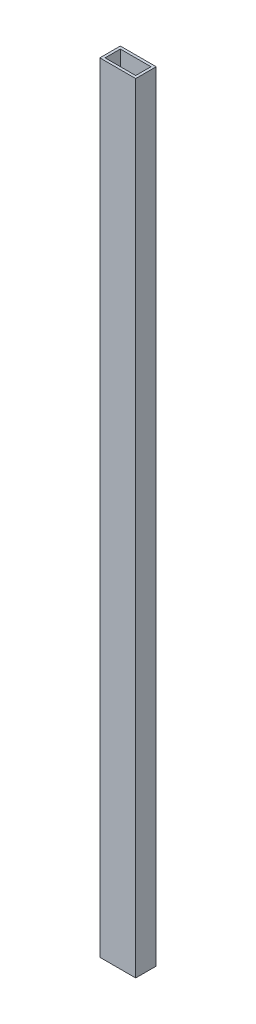
ISO-10303-21;
HEADER;
FILE_DESCRIPTION(('STEP AP214'),'2;1');
FILE_NAME('part.step','',(''),(''),'','','');
FILE_SCHEMA(('AUTOMOTIVE_DESIGN { 1 0 10303 214 1 1 1 1 }'));
ENDSEC;
DATA;
#1=APPLICATION_CONTEXT('core data for automotive mechanical design processes');
#2=APPLICATION_PROTOCOL_DEFINITION('international standard','automotive_design',2000,#1);
#3=PRODUCT_CONTEXT('',#1,'mechanical');
#4=PRODUCT('Part','Part','',(#3));
#5=PRODUCT_RELATED_PRODUCT_CATEGORY('part','',(#4));
#6=PRODUCT_DEFINITION_FORMATION('','',#4);
#7=PRODUCT_DEFINITION_CONTEXT('part definition',#1,'design');
#8=PRODUCT_DEFINITION('design','',#6,#7);
#9=PRODUCT_DEFINITION_SHAPE('','',#8);
#10=(LENGTH_UNIT() NAMED_UNIT(*) SI_UNIT(.MILLI.,.METRE.));
#11=(NAMED_UNIT(*) PLANE_ANGLE_UNIT() SI_UNIT($,.RADIAN.));
#12=(NAMED_UNIT(*) SI_UNIT($,.STERADIAN.) SOLID_ANGLE_UNIT());
#13=UNCERTAINTY_MEASURE_WITH_UNIT(LENGTH_MEASURE(1.E-05),#10,'distance_accuracy_value','');
#14=(GEOMETRIC_REPRESENTATION_CONTEXT(3) GLOBAL_UNCERTAINTY_ASSIGNED_CONTEXT((#13)) GLOBAL_UNIT_ASSIGNED_CONTEXT((#10,
#11,#12)) REPRESENTATION_CONTEXT('',''));
#15=CARTESIAN_POINT('',(0.,0.,0.));
#16=DIRECTION('',(0.,0.,1.));
#17=DIRECTION('',(1.,0.,0.));
#18=AXIS2_PLACEMENT_3D('',#15,#16,#17);
#19=CARTESIAN_POINT('',(0.,965.2,0.));
#20=DIRECTION('',(1.,0.,0.));
#21=DIRECTION('',(0.,0.,-1.));
#22=AXIS2_PLACEMENT_3D('',#19,#20,#21);
#23=PLANE('',#22);
#24=DIRECTION('',(0.,0.,1.));
#25=VECTOR('',#24,1.);
#26=CARTESIAN_POINT('',(0.,0.,0.));
#27=LINE('',#26,#25);
#28=CARTESIAN_POINT('',(0.,0.,-25.4));
#29=VERTEX_POINT('',#28);
#30=CARTESIAN_POINT('',(0.,0.,0.));
#31=VERTEX_POINT('',#30);
#32=EDGE_CURVE('E134',#29,#31,#27,.T.);
#33=ORIENTED_EDGE('',*,*,#32,.T.);
#34=DIRECTION('',(0.,-1.,0.));
#35=VECTOR('',#34,1.);
#36=CARTESIAN_POINT('',(0.,965.2,0.));
#37=LINE('',#36,#35);
#38=CARTESIAN_POINT('',(0.,965.2,0.));
#39=VERTEX_POINT('',#38);
#40=EDGE_CURVE('E176',#39,#31,#37,.T.);
#41=ORIENTED_EDGE('',*,*,#40,.F.);
#42=DIRECTION('',(0.,0.,1.));
#43=VECTOR('',#42,1.);
#44=CARTESIAN_POINT('',(0.,965.2,0.));
#45=LINE('',#44,#43);
#46=CARTESIAN_POINT('',(0.,965.2,-25.4));
#47=VERTEX_POINT('',#46);
#48=EDGE_CURVE('E139',#47,#39,#45,.T.);
#49=ORIENTED_EDGE('',*,*,#48,.F.);
#50=DIRECTION('',(0.,-1.,0.));
#51=VECTOR('',#50,1.);
#52=CARTESIAN_POINT('',(0.,965.2,-25.4));
#53=LINE('',#52,#51);
#54=EDGE_CURVE('E153',#47,#29,#53,.T.);
#55=ORIENTED_EDGE('',*,*,#54,.T.);
#56=EDGE_LOOP('',(#33,#41,#49,#55));
#57=FACE_BOUND('',#56,.T.);
#58=ADVANCED_FACE('F39',(#57),#23,.F.);
#59=CARTESIAN_POINT('',(0.,965.2,0.));
#60=DIRECTION('',(0.,0.,-1.));
#61=DIRECTION('',(-1.,0.,0.));
#62=AXIS2_PLACEMENT_3D('',#59,#60,#61);
#63=PLANE('',#62);
#64=DIRECTION('',(1.,0.,0.));
#65=VECTOR('',#64,1.);
#66=CARTESIAN_POINT('',(0.,0.,0.));
#67=LINE('',#66,#65);
#68=CARTESIAN_POINT('',(44.45,0.,0.));
#69=VERTEX_POINT('',#68);
#70=EDGE_CURVE('E157',#31,#69,#67,.T.);
#71=ORIENTED_EDGE('',*,*,#70,.T.);
#72=DIRECTION('',(0.,-1.,0.));
#73=VECTOR('',#72,1.);
#74=CARTESIAN_POINT('',(44.45,965.2,0.));
#75=LINE('',#74,#73);
#76=CARTESIAN_POINT('',(44.45,965.2,0.));
#77=VERTEX_POINT('',#76);
#78=EDGE_CURVE('E172',#77,#69,#75,.T.);
#79=ORIENTED_EDGE('',*,*,#78,.F.);
#80=DIRECTION('',(1.,0.,0.));
#81=VECTOR('',#80,1.);
#82=CARTESIAN_POINT('',(0.,965.2,0.));
#83=LINE('',#82,#81);
#84=EDGE_CURVE('E143',#39,#77,#83,.T.);
#85=ORIENTED_EDGE('',*,*,#84,.F.);
#86=ORIENTED_EDGE('',*,*,#40,.T.);
#87=EDGE_LOOP('',(#71,#79,#85,#86));
#88=FACE_BOUND('',#87,.T.);
#89=ADVANCED_FACE('F206',(#88),#63,.F.);
#90=CARTESIAN_POINT('',(44.45,965.2,0.));
#91=DIRECTION('',(-1.,0.,0.));
#92=DIRECTION('',(0.,0.,1.));
#93=AXIS2_PLACEMENT_3D('',#90,#91,#92);
#94=PLANE('',#93);
#95=DIRECTION('',(0.,0.,-1.));
#96=VECTOR('',#95,1.);
#97=CARTESIAN_POINT('',(44.45,0.,0.));
#98=LINE('',#97,#96);
#99=CARTESIAN_POINT('',(44.45,0.,-25.4));
#100=VERTEX_POINT('',#99);
#101=EDGE_CURVE('E160',#69,#100,#98,.T.);
#102=ORIENTED_EDGE('',*,*,#101,.T.);
#103=DIRECTION('',(0.,-1.,0.));
#104=VECTOR('',#103,1.);
#105=CARTESIAN_POINT('',(44.45,965.2,-25.4));
#106=LINE('',#105,#104);
#107=CARTESIAN_POINT('',(44.45,965.2,-25.4));
#108=VERTEX_POINT('',#107);
#109=EDGE_CURVE('E168',#108,#100,#106,.T.);
#110=ORIENTED_EDGE('',*,*,#109,.F.);
#111=DIRECTION('',(0.,0.,-1.));
#112=VECTOR('',#111,1.);
#113=CARTESIAN_POINT('',(44.45,965.2,0.));
#114=LINE('',#113,#112);
#115=EDGE_CURVE('E147',#77,#108,#114,.T.);
#116=ORIENTED_EDGE('',*,*,#115,.F.);
#117=ORIENTED_EDGE('',*,*,#78,.T.);
#118=EDGE_LOOP('',(#102,#110,#116,#117));
#119=FACE_BOUND('',#118,.T.);
#120=ADVANCED_FACE('F211',(#119),#94,.F.);
#121=CARTESIAN_POINT('',(0.,965.2,-25.4));
#122=DIRECTION('',(0.,0.,1.));
#123=DIRECTION('',(1.,0.,0.));
#124=AXIS2_PLACEMENT_3D('',#121,#122,#123);
#125=PLANE('',#124);
#126=DIRECTION('',(-1.,0.,0.));
#127=VECTOR('',#126,1.);
#128=CARTESIAN_POINT('',(0.,0.,-25.4));
#129=LINE('',#128,#127);
#130=EDGE_CURVE('E144',#100,#29,#129,.T.);
#131=ORIENTED_EDGE('',*,*,#130,.T.);
#132=ORIENTED_EDGE('',*,*,#54,.F.);
#133=DIRECTION('',(-1.,0.,0.));
#134=VECTOR('',#133,1.);
#135=CARTESIAN_POINT('',(0.,965.2,-25.4));
#136=LINE('',#135,#134);
#137=EDGE_CURVE('E150',#108,#47,#136,.T.);
#138=ORIENTED_EDGE('',*,*,#137,.F.);
#139=ORIENTED_EDGE('',*,*,#109,.T.);
#140=EDGE_LOOP('',(#131,#132,#138,#139));
#141=FACE_BOUND('',#140,.T.);
#142=ADVANCED_FACE('F224',(#141),#125,.F.);
#143=CARTESIAN_POINT('',(0.,965.2,0.));
#144=DIRECTION('',(0.,-1.,0.));
#145=DIRECTION('',(0.,0.,-1.));
#146=AXIS2_PLACEMENT_3D('',#143,#144,#145);
#147=PLANE('',#146);
#148=DIRECTION('',(-1.,0.,0.));
#149=VECTOR('',#148,1.);
#150=CARTESIAN_POINT('',(3.2385,965.2,-22.1615));
#151=LINE('',#150,#149);
#152=CARTESIAN_POINT('',(41.2115,965.2,-22.1615));
#153=VERTEX_POINT('',#152);
#154=CARTESIAN_POINT('',(3.2385,965.2,-22.1615));
#155=VERTEX_POINT('',#154);
#156=EDGE_CURVE('E116',#153,#155,#151,.T.);
#157=ORIENTED_EDGE('',*,*,#156,.F.);
#158=DIRECTION('',(0.,0.,-1.));
#159=VECTOR('',#158,1.);
#160=CARTESIAN_POINT('',(41.2115,965.2,-3.2385));
#161=LINE('',#160,#159);
#162=CARTESIAN_POINT('',(41.2115,965.2,-3.2385));
#163=VERTEX_POINT('',#162);
#164=EDGE_CURVE('E54',#163,#153,#161,.T.);
#165=ORIENTED_EDGE('',*,*,#164,.F.);
#166=DIRECTION('',(1.,0.,0.));
#167=VECTOR('',#166,1.);
#168=CARTESIAN_POINT('',(3.2385,965.2,-3.2385));
#169=LINE('',#168,#167);
#170=CARTESIAN_POINT('',(3.2385,965.2,-3.2385));
#171=VERTEX_POINT('',#170);
#172=EDGE_CURVE('E124',#171,#163,#169,.T.);
#173=ORIENTED_EDGE('',*,*,#172,.F.);
#174=DIRECTION('',(0.,0.,1.));
#175=VECTOR('',#174,1.);
#176=CARTESIAN_POINT('',(3.2385,965.2,-22.1615));
#177=LINE('',#176,#175);
#178=EDGE_CURVE('E106',#155,#171,#177,.T.);
#179=ORIENTED_EDGE('',*,*,#178,.F.);
#180=EDGE_LOOP('',(#157,#165,#173,#179));
#181=FACE_BOUND('',#180,.T.);
#182=ORIENTED_EDGE('',*,*,#48,.T.);
#183=ORIENTED_EDGE('',*,*,#84,.T.);
#184=ORIENTED_EDGE('',*,*,#115,.T.);
#185=ORIENTED_EDGE('',*,*,#137,.T.);
#186=EDGE_LOOP('',(#182,#183,#184,#185));
#187=FACE_BOUND('',#186,.T.);
#188=ADVANCED_FACE('F121',(#181,#187),#147,.F.);
#189=CARTESIAN_POINT('',(0.,0.,0.));
#190=DIRECTION('',(0.,-1.,0.));
#191=DIRECTION('',(0.,0.,-1.));
#192=AXIS2_PLACEMENT_3D('',#189,#190,#191);
#193=PLANE('',#192);
#194=DIRECTION('',(0.,0.,1.));
#195=VECTOR('',#194,1.);
#196=CARTESIAN_POINT('',(41.2115,0.,0.));
#197=LINE('',#196,#195);
#198=CARTESIAN_POINT('',(41.2115,0.,-22.1615));
#199=VERTEX_POINT('',#198);
#200=CARTESIAN_POINT('',(41.2115,0.,-3.2385));
#201=VERTEX_POINT('',#200);
#202=EDGE_CURVE('E11',#199,#201,#197,.T.);
#203=ORIENTED_EDGE('',*,*,#202,.F.);
#204=DIRECTION('',(1.,0.,0.));
#205=VECTOR('',#204,1.);
#206=CARTESIAN_POINT('',(0.,0.,-22.1615));
#207=LINE('',#206,#205);
#208=CARTESIAN_POINT('',(3.2385,0.,-22.1615));
#209=VERTEX_POINT('',#208);
#210=EDGE_CURVE('E180',#209,#199,#207,.T.);
#211=ORIENTED_EDGE('',*,*,#210,.F.);
#212=DIRECTION('',(0.,0.,-1.));
#213=VECTOR('',#212,1.);
#214=CARTESIAN_POINT('',(3.2385,0.,0.));
#215=LINE('',#214,#213);
#216=CARTESIAN_POINT('',(3.2385,0.,-3.2385));
#217=VERTEX_POINT('',#216);
#218=EDGE_CURVE('E109',#217,#209,#215,.T.);
#219=ORIENTED_EDGE('',*,*,#218,.F.);
#220=DIRECTION('',(-1.,0.,0.));
#221=VECTOR('',#220,1.);
#222=CARTESIAN_POINT('',(0.,0.,-3.2385));
#223=LINE('',#222,#221);
#224=EDGE_CURVE('E47',#201,#217,#223,.T.);
#225=ORIENTED_EDGE('',*,*,#224,.F.);
#226=EDGE_LOOP('',(#203,#211,#219,#225));
#227=FACE_BOUND('',#226,.T.);
#228=ORIENTED_EDGE('',*,*,#32,.F.);
#229=ORIENTED_EDGE('',*,*,#130,.F.);
#230=ORIENTED_EDGE('',*,*,#101,.F.);
#231=ORIENTED_EDGE('',*,*,#70,.F.);
#232=EDGE_LOOP('',(#228,#229,#230,#231));
#233=FACE_BOUND('',#232,.T.);
#234=ADVANCED_FACE('F191',(#227,#233),#193,.T.);
#235=CARTESIAN_POINT('',(41.2115,-127.,-3.2385));
#236=DIRECTION('',(1.,0.,0.));
#237=DIRECTION('',(0.,0.,-1.));
#238=AXIS2_PLACEMENT_3D('',#235,#236,#237);
#239=PLANE('',#238);
#240=ORIENTED_EDGE('',*,*,#202,.T.);
#241=DIRECTION('',(0.,1.,0.));
#242=VECTOR('',#241,1.);
#243=CARTESIAN_POINT('',(41.2115,-127.,-3.2385));
#244=LINE('',#243,#242);
#245=EDGE_CURVE('E131',#201,#163,#244,.T.);
#246=ORIENTED_EDGE('',*,*,#245,.T.);
#247=ORIENTED_EDGE('',*,*,#164,.T.);
#248=DIRECTION('',(0.,1.,0.));
#249=VECTOR('',#248,1.);
#250=CARTESIAN_POINT('',(41.2115,-127.,-22.1615));
#251=LINE('',#250,#249);
#252=EDGE_CURVE('E113',#199,#153,#251,.T.);
#253=ORIENTED_EDGE('',*,*,#252,.F.);
#254=EDGE_LOOP('',(#240,#246,#247,#253));
#255=FACE_BOUND('',#254,.T.);
#256=ADVANCED_FACE('F193',(#255),#239,.F.);
#257=CARTESIAN_POINT('',(3.2385,-127.,-3.2385));
#258=DIRECTION('',(0.,0.,1.));
#259=DIRECTION('',(1.,0.,0.));
#260=AXIS2_PLACEMENT_3D('',#257,#258,#259);
#261=PLANE('',#260);
#262=ORIENTED_EDGE('',*,*,#224,.T.);
#263=DIRECTION('',(0.,1.,0.));
#264=VECTOR('',#263,1.);
#265=CARTESIAN_POINT('',(3.2385,-127.,-3.2385));
#266=LINE('',#265,#264);
#267=EDGE_CURVE('E112',#217,#171,#266,.T.);
#268=ORIENTED_EDGE('',*,*,#267,.T.);
#269=ORIENTED_EDGE('',*,*,#172,.T.);
#270=ORIENTED_EDGE('',*,*,#245,.F.);
#271=EDGE_LOOP('',(#262,#268,#269,#270));
#272=FACE_BOUND('',#271,.T.);
#273=ADVANCED_FACE('F188',(#272),#261,.F.);
#274=CARTESIAN_POINT('',(3.2385,-127.,-22.1615));
#275=DIRECTION('',(-1.,0.,0.));
#276=DIRECTION('',(0.,0.,1.));
#277=AXIS2_PLACEMENT_3D('',#274,#275,#276);
#278=PLANE('',#277);
#279=ORIENTED_EDGE('',*,*,#218,.T.);
#280=DIRECTION('',(0.,1.,0.));
#281=VECTOR('',#280,1.);
#282=CARTESIAN_POINT('',(3.2385,-127.,-22.1615));
#283=LINE('',#282,#281);
#284=EDGE_CURVE('E62',#209,#155,#283,.T.);
#285=ORIENTED_EDGE('',*,*,#284,.T.);
#286=ORIENTED_EDGE('',*,*,#178,.T.);
#287=ORIENTED_EDGE('',*,*,#267,.F.);
#288=EDGE_LOOP('',(#279,#285,#286,#287));
#289=FACE_BOUND('',#288,.T.);
#290=ADVANCED_FACE('F103',(#289),#278,.F.);
#291=CARTESIAN_POINT('',(3.2385,-127.,-22.1615));
#292=DIRECTION('',(0.,0.,-1.));
#293=DIRECTION('',(-1.,0.,0.));
#294=AXIS2_PLACEMENT_3D('',#291,#292,#293);
#295=PLANE('',#294);
#296=ORIENTED_EDGE('',*,*,#210,.T.);
#297=ORIENTED_EDGE('',*,*,#252,.T.);
#298=ORIENTED_EDGE('',*,*,#156,.T.);
#299=ORIENTED_EDGE('',*,*,#284,.F.);
#300=EDGE_LOOP('',(#296,#297,#298,#299));
#301=FACE_BOUND('',#300,.T.);
#302=ADVANCED_FACE('F117',(#301),#295,.F.);
#303=CLOSED_SHELL('',(#58,#89,#120,#142,#188,#234,#256,#273,#290,#302));
#304=MANIFOLD_SOLID_BREP('B2',#303);
#305=ADVANCED_BREP_SHAPE_REPRESENTATION('',(#18,#304),#14);
#306=SHAPE_DEFINITION_REPRESENTATION(#9,#305);
ENDSEC;
END-ISO-10303-21;
